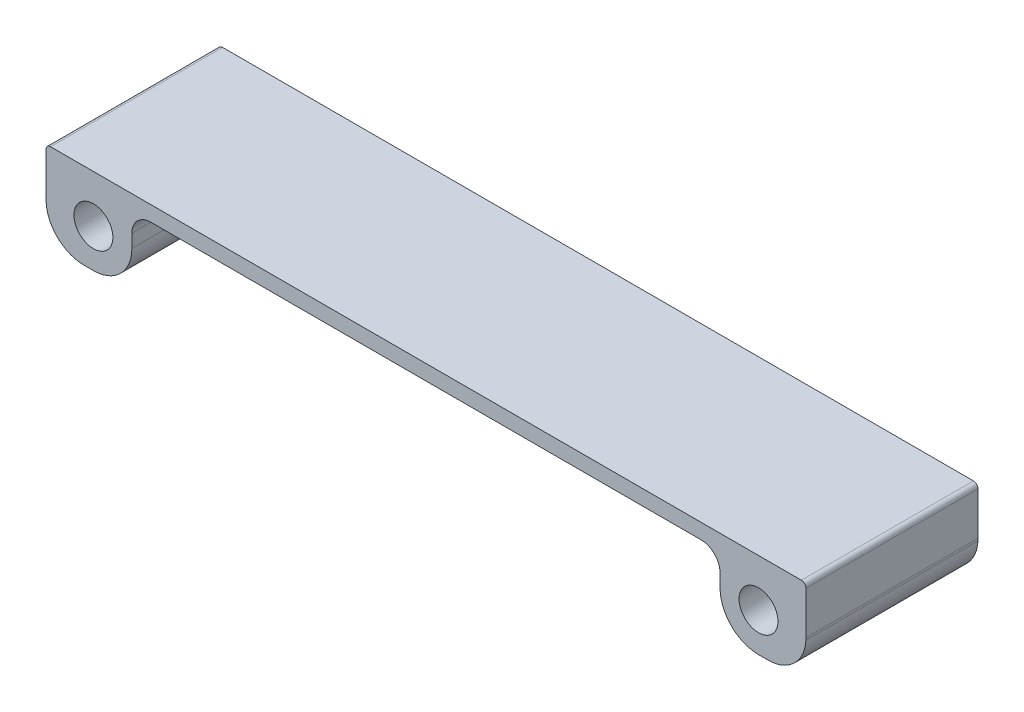
ISO-10303-21;
HEADER;
FILE_DESCRIPTION(('STEP AP214'),'2;1');
FILE_NAME('part.step','',(''),(''),'','','');
FILE_SCHEMA(('AUTOMOTIVE_DESIGN { 1 0 10303 214 1 1 1 1 }'));
ENDSEC;
DATA;
#1=APPLICATION_CONTEXT('core data for automotive mechanical design processes');
#2=APPLICATION_PROTOCOL_DEFINITION('international standard','automotive_design',2000,#1);
#3=PRODUCT_CONTEXT('',#1,'mechanical');
#4=PRODUCT('Part','Part','',(#3));
#5=PRODUCT_RELATED_PRODUCT_CATEGORY('part','',(#4));
#6=PRODUCT_DEFINITION_FORMATION('','',#4);
#7=PRODUCT_DEFINITION_CONTEXT('part definition',#1,'design');
#8=PRODUCT_DEFINITION('design','',#6,#7);
#9=PRODUCT_DEFINITION_SHAPE('','',#8);
#10=(LENGTH_UNIT() NAMED_UNIT(*) SI_UNIT(.MILLI.,.METRE.));
#11=(NAMED_UNIT(*) PLANE_ANGLE_UNIT() SI_UNIT($,.RADIAN.));
#12=(NAMED_UNIT(*) SI_UNIT($,.STERADIAN.) SOLID_ANGLE_UNIT());
#13=UNCERTAINTY_MEASURE_WITH_UNIT(LENGTH_MEASURE(1.E-05),#10,'distance_accuracy_value','');
#14=(GEOMETRIC_REPRESENTATION_CONTEXT(3) GLOBAL_UNCERTAINTY_ASSIGNED_CONTEXT((#13)) GLOBAL_UNIT_ASSIGNED_CONTEXT((#10,
#11,#12)) REPRESENTATION_CONTEXT('',''));
#15=CARTESIAN_POINT('',(0.,0.,0.));
#16=DIRECTION('',(0.,0.,1.));
#17=DIRECTION('',(1.,0.,0.));
#18=AXIS2_PLACEMENT_3D('',#15,#16,#17);
#19=CARTESIAN_POINT('',(111.1504,-6.4262,28.7528));
#20=DIRECTION('',(0.,1.,0.));
#21=DIRECTION('',(0.,0.,1.));
#22=AXIS2_PLACEMENT_3D('',#19,#20,#21);
#23=PLANE('',#22);
#24=DIRECTION('',(0.,0.,-1.));
#25=VECTOR('',#24,1.);
#26=CARTESIAN_POINT('',(112.723355371268,-6.42619999999999,28.7528));
#27=LINE('',#26,#25);
#28=CARTESIAN_POINT('',(112.723355371268,-6.4262,28.7528));
#29=VERTEX_POINT('',#28);
#30=CARTESIAN_POINT('',(112.723355371268,-6.4262,0.));
#31=VERTEX_POINT('',#30);
#32=EDGE_CURVE('E270',#29,#31,#27,.T.);
#33=ORIENTED_EDGE('',*,*,#32,.F.);
#34=DIRECTION('',(1.,0.,0.));
#35=VECTOR('',#34,1.);
#36=CARTESIAN_POINT('',(111.1504,-6.4262,28.7528));
#37=LINE('',#36,#35);
#38=CARTESIAN_POINT('',(111.1504,-6.4262,28.7528));
#39=VERTEX_POINT('',#38);
#40=EDGE_CURVE('E279',#39,#29,#37,.T.);
#41=ORIENTED_EDGE('',*,*,#40,.F.);
#42=DIRECTION('',(0.,0.,-1.));
#43=VECTOR('',#42,1.);
#44=CARTESIAN_POINT('',(111.1504,-6.42619999999999,28.7528));
#45=LINE('',#44,#43);
#46=CARTESIAN_POINT('',(111.1504,-6.4262,0.));
#47=VERTEX_POINT('',#46);
#48=EDGE_CURVE('E267',#47,#39,#45,.F.);
#49=ORIENTED_EDGE('',*,*,#48,.F.);
#50=DIRECTION('',(1.,0.,0.));
#51=VECTOR('',#50,1.);
#52=CARTESIAN_POINT('',(111.1504,-6.4262,0.));
#53=LINE('',#52,#51);
#54=EDGE_CURVE('E276',#31,#47,#53,.F.);
#55=ORIENTED_EDGE('',*,*,#54,.F.);
#56=EDGE_LOOP('',(#33,#41,#49,#55));
#57=FACE_BOUND('',#56,.T.);
#58=ADVANCED_FACE('F17',(#57),#23,.F.);
#59=CARTESIAN_POINT('',(0.,-6.4262,28.7528));
#60=DIRECTION('',(0.,1.,0.));
#61=DIRECTION('',(0.,0.,1.));
#62=AXIS2_PLACEMENT_3D('',#59,#60,#61);
#63=PLANE('',#62);
#64=DIRECTION('',(0.,0.,-1.));
#65=VECTOR('',#64,1.);
#66=CARTESIAN_POINT('',(-1.57295537126772,-6.4262,28.7528));
#67=LINE('',#66,#65);
#68=CARTESIAN_POINT('',(-1.57295537126772,-6.4262,0.));
#69=VERTEX_POINT('',#68);
#70=CARTESIAN_POINT('',(-1.57295537126772,-6.4262,28.7528));
#71=VERTEX_POINT('',#70);
#72=EDGE_CURVE('E153',#69,#71,#67,.F.);
#73=ORIENTED_EDGE('',*,*,#72,.F.);
#74=DIRECTION('',(1.,0.,0.));
#75=VECTOR('',#74,1.);
#76=CARTESIAN_POINT('',(0.,-6.4262,0.));
#77=LINE('',#76,#75);
#78=CARTESIAN_POINT('',(0.,-6.4262,0.));
#79=VERTEX_POINT('',#78);
#80=EDGE_CURVE('E159',#79,#69,#77,.F.);
#81=ORIENTED_EDGE('',*,*,#80,.F.);
#82=DIRECTION('',(0.,0.,-1.));
#83=VECTOR('',#82,1.);
#84=CARTESIAN_POINT('',(0.,-6.4262,28.7528));
#85=LINE('',#84,#83);
#86=CARTESIAN_POINT('',(0.,-6.4262,28.7528));
#87=VERTEX_POINT('',#86);
#88=EDGE_CURVE('E154',#87,#79,#85,.T.);
#89=ORIENTED_EDGE('',*,*,#88,.F.);
#90=DIRECTION('',(1.,0.,0.));
#91=VECTOR('',#90,1.);
#92=CARTESIAN_POINT('',(0.,-6.4262,28.7528));
#93=LINE('',#92,#91);
#94=EDGE_CURVE('E145',#71,#87,#93,.T.);
#95=ORIENTED_EDGE('',*,*,#94,.F.);
#96=EDGE_LOOP('',(#73,#81,#89,#95));
#97=FACE_BOUND('',#96,.T.);
#98=ADVANCED_FACE('F499',(#97),#63,.F.);
#99=CARTESIAN_POINT('',(0.,0.,28.7528));
#100=DIRECTION('',(0.,0.,-1.));
#101=DIRECTION('',(-1.,0.,0.));
#102=AXIS2_PLACEMENT_3D('',#99,#100,#101);
#103=CYLINDRICAL_SURFACE('',#102,7.92479999999999);
#104=CARTESIAN_POINT('',(0.,0.,28.7528));
#105=DIRECTION('',(0.,0.,-1.));
#106=DIRECTION('',(-1.,0.,0.));
#107=AXIS2_PLACEMENT_3D('',#104,#105,#106);
#108=CIRCLE('',#107,7.92479999999999);
#109=CARTESIAN_POINT('',(-7.91551735218598,-0.38345806451614,28.7528));
#110=VERTEX_POINT('',#109);
#111=CARTESIAN_POINT('',(-7.9248,0.,28.7528));
#112=VERTEX_POINT('',#111);
#113=EDGE_CURVE('E144',#110,#112,#108,.T.);
#114=ORIENTED_EDGE('',*,*,#113,.T.);
#115=DIRECTION('',(0.,0.,1.));
#116=VECTOR('',#115,1.);
#117=CARTESIAN_POINT('',(-7.9248,0.,28.7528));
#118=LINE('',#117,#116);
#119=CARTESIAN_POINT('',(-7.9248,0.,0.));
#120=VERTEX_POINT('',#119);
#121=EDGE_CURVE('E142',#112,#120,#118,.F.);
#122=ORIENTED_EDGE('',*,*,#121,.T.);
#123=CARTESIAN_POINT('',(0.,0.,0.));
#124=DIRECTION('',(0.,0.,-1.));
#125=DIRECTION('',(-1.,0.,0.));
#126=AXIS2_PLACEMENT_3D('',#123,#124,#125);
#127=CIRCLE('',#126,7.92479999999999);
#128=CARTESIAN_POINT('',(-7.91551735218598,-0.38345806451614,0.));
#129=VERTEX_POINT('',#128);
#130=EDGE_CURVE('E20',#120,#129,#127,.F.);
#131=ORIENTED_EDGE('',*,*,#130,.T.);
#132=DIRECTION('',(0.,0.,-1.));
#133=VECTOR('',#132,1.);
#134=CARTESIAN_POINT('',(-7.91551735218598,-0.383458064516141,28.7528));
#135=LINE('',#134,#133);
#136=EDGE_CURVE('E139',#110,#129,#135,.T.);
#137=ORIENTED_EDGE('',*,*,#136,.F.);
#138=EDGE_LOOP('',(#114,#122,#131,#137));
#139=FACE_BOUND('',#138,.T.);
#140=ADVANCED_FACE('F138',(#139),#103,.T.);
#141=CARTESIAN_POINT('',(111.1504,0.,28.7528));
#142=DIRECTION('',(0.,0.,-1.));
#143=DIRECTION('',(-1.,0.,0.));
#144=AXIS2_PLACEMENT_3D('',#141,#142,#143);
#145=CYLINDRICAL_SURFACE('',#144,7.9248);
#146=CARTESIAN_POINT('',(111.1504,0.,0.));
#147=DIRECTION('',(0.,0.,-1.));
#148=DIRECTION('',(-1.,0.,0.));
#149=AXIS2_PLACEMENT_3D('',#146,#147,#148);
#150=CIRCLE('',#149,7.9248);
#151=CARTESIAN_POINT('',(119.065917352186,-0.383458064516131,0.));
#152=VERTEX_POINT('',#151);
#153=CARTESIAN_POINT('',(119.0752,0.,0.));
#154=VERTEX_POINT('',#153);
#155=EDGE_CURVE('E215',#152,#154,#150,.F.);
#156=ORIENTED_EDGE('',*,*,#155,.T.);
#157=DIRECTION('',(0.,0.,1.));
#158=VECTOR('',#157,1.);
#159=CARTESIAN_POINT('',(119.0752,0.,28.7528));
#160=LINE('',#159,#158);
#161=CARTESIAN_POINT('',(119.0752,0.,28.7528));
#162=VERTEX_POINT('',#161);
#163=EDGE_CURVE('E226',#154,#162,#160,.T.);
#164=ORIENTED_EDGE('',*,*,#163,.T.);
#165=CARTESIAN_POINT('',(111.1504,0.,28.7528));
#166=DIRECTION('',(0.,0.,-1.));
#167=DIRECTION('',(-1.,0.,0.));
#168=AXIS2_PLACEMENT_3D('',#165,#166,#167);
#169=CIRCLE('',#168,7.9248);
#170=CARTESIAN_POINT('',(119.065917352186,-0.383458064516131,28.7528));
#171=VERTEX_POINT('',#170);
#172=EDGE_CURVE('E218',#162,#171,#169,.T.);
#173=ORIENTED_EDGE('',*,*,#172,.T.);
#174=DIRECTION('',(0.,0.,-1.));
#175=VECTOR('',#174,1.);
#176=CARTESIAN_POINT('',(119.065917352186,-0.38345806451613,28.7528));
#177=LINE('',#176,#175);
#178=EDGE_CURVE('E217',#152,#171,#177,.F.);
#179=ORIENTED_EDGE('',*,*,#178,.F.);
#180=EDGE_LOOP('',(#156,#164,#173,#179));
#181=FACE_BOUND('',#180,.T.);
#182=ADVANCED_FACE('F480',(#181),#145,.T.);
#183=CARTESIAN_POINT('',(112.723355371268,-0.0762000000000002,28.7528));
#184=DIRECTION('',(0.,0.,-1.));
#185=DIRECTION('',(-1.,0.,0.));
#186=AXIS2_PLACEMENT_3D('',#183,#184,#185);
#187=CYLINDRICAL_SURFACE('',#186,6.34999999999999);
#188=CARTESIAN_POINT('',(112.723355371268,-0.0762000000000002,28.7528));
#189=DIRECTION('',(0.,0.,-1.));
#190=DIRECTION('',(-1.,0.,0.));
#191=AXIS2_PLACEMENT_3D('',#188,#189,#190);
#192=CIRCLE('',#191,6.34999999999999);
#193=EDGE_CURVE('E187',#171,#29,#192,.T.);
#194=ORIENTED_EDGE('',*,*,#193,.T.);
#195=ORIENTED_EDGE('',*,*,#32,.T.);
#196=CARTESIAN_POINT('',(112.723355371268,-0.0762000000000002,0.));
#197=DIRECTION('',(0.,0.,-1.));
#198=DIRECTION('',(-1.,0.,0.));
#199=AXIS2_PLACEMENT_3D('',#196,#197,#198);
#200=CIRCLE('',#199,6.34999999999999);
#201=EDGE_CURVE('E178',#152,#31,#200,.T.);
#202=ORIENTED_EDGE('',*,*,#201,.F.);
#203=ORIENTED_EDGE('',*,*,#178,.T.);
#204=EDGE_LOOP('',(#194,#195,#202,#203));
#205=FACE_BOUND('',#204,.T.);
#206=ADVANCED_FACE('F470',(#205),#187,.T.);
#207=CARTESIAN_POINT('',(111.1504,0.,28.7528));
#208=DIRECTION('',(0.,0.,-1.));
#209=DIRECTION('',(-1.,0.,0.));
#210=AXIS2_PLACEMENT_3D('',#207,#208,#209);
#211=CYLINDRICAL_SURFACE('',#210,6.42619999999999);
#212=CARTESIAN_POINT('',(111.1504,0.,28.7528));
#213=DIRECTION('',(0.,0.,-1.));
#214=DIRECTION('',(-1.,0.,0.));
#215=AXIS2_PLACEMENT_3D('',#212,#213,#214);
#216=CIRCLE('',#215,6.42619999999999);
#217=CARTESIAN_POINT('',(104.7242,0.,28.7528));
#218=VERTEX_POINT('',#217);
#219=EDGE_CURVE('E208',#39,#218,#216,.T.);
#220=ORIENTED_EDGE('',*,*,#219,.T.);
#221=DIRECTION('',(0.,0.,1.));
#222=VECTOR('',#221,1.);
#223=CARTESIAN_POINT('',(104.7242,0.,28.7528));
#224=LINE('',#223,#222);
#225=CARTESIAN_POINT('',(104.7242,0.,0.));
#226=VERTEX_POINT('',#225);
#227=EDGE_CURVE('E264',#218,#226,#224,.F.);
#228=ORIENTED_EDGE('',*,*,#227,.T.);
#229=CARTESIAN_POINT('',(111.1504,0.,0.));
#230=DIRECTION('',(0.,0.,-1.));
#231=DIRECTION('',(-1.,0.,0.));
#232=AXIS2_PLACEMENT_3D('',#229,#230,#231);
#233=CIRCLE('',#232,6.42619999999999);
#234=EDGE_CURVE('E176',#47,#226,#233,.T.);
#235=ORIENTED_EDGE('',*,*,#234,.F.);
#236=ORIENTED_EDGE('',*,*,#48,.T.);
#237=EDGE_LOOP('',(#220,#228,#235,#236));
#238=FACE_BOUND('',#237,.T.);
#239=ADVANCED_FACE('F460',(#238),#211,.T.);
#240=CARTESIAN_POINT('',(104.7242,0.,28.7528));
#241=DIRECTION('',(1.,0.,0.));
#242=DIRECTION('',(0.,1.,0.));
#243=AXIS2_PLACEMENT_3D('',#240,#241,#242);
#244=PLANE('',#243);
#245=ORIENTED_EDGE('',*,*,#227,.F.);
#246=DIRECTION('',(0.,1.,0.));
#247=VECTOR('',#246,1.);
#248=CARTESIAN_POINT('',(104.7242,-5.6642,28.7528));
#249=LINE('',#248,#247);
#250=CARTESIAN_POINT('',(104.7242,2.2098,28.7528));
#251=VERTEX_POINT('',#250);
#252=EDGE_CURVE('E207',#218,#251,#249,.T.);
#253=ORIENTED_EDGE('',*,*,#252,.T.);
#254=DIRECTION('',(0.,0.,-1.));
#255=VECTOR('',#254,1.);
#256=CARTESIAN_POINT('',(104.7242,2.2098,28.7528));
#257=LINE('',#256,#255);
#258=CARTESIAN_POINT('',(104.7242,2.2098,0.));
#259=VERTEX_POINT('',#258);
#260=EDGE_CURVE('E261',#251,#259,#257,.T.);
#261=ORIENTED_EDGE('',*,*,#260,.T.);
#262=DIRECTION('',(0.,1.,0.));
#263=VECTOR('',#262,1.);
#264=CARTESIAN_POINT('',(104.7242,-5.6642,0.));
#265=LINE('',#264,#263);
#266=EDGE_CURVE('E175',#226,#259,#265,.T.);
#267=ORIENTED_EDGE('',*,*,#266,.F.);
#268=EDGE_LOOP('',(#245,#253,#261,#267));
#269=FACE_BOUND('',#268,.T.);
#270=ADVANCED_FACE('F450',(#269),#244,.F.);
#271=CARTESIAN_POINT('',(101.5492,2.2098,28.7528));
#272=DIRECTION('',(0.,0.,-1.));
#273=DIRECTION('',(-1.,0.,0.));
#274=AXIS2_PLACEMENT_3D('',#271,#272,#273);
#275=CYLINDRICAL_SURFACE('',#274,3.17500000000001);
#276=ORIENTED_EDGE('',*,*,#260,.F.);
#277=CARTESIAN_POINT('',(101.5492,2.2098,28.7528));
#278=DIRECTION('',(0.,0.,-1.));
#279=DIRECTION('',(-1.,0.,0.));
#280=AXIS2_PLACEMENT_3D('',#277,#278,#279);
#281=CIRCLE('',#280,3.17500000000001);
#282=CARTESIAN_POINT('',(101.5492,5.3848,28.7528));
#283=VERTEX_POINT('',#282);
#284=EDGE_CURVE('E204',#251,#283,#281,.F.);
#285=ORIENTED_EDGE('',*,*,#284,.T.);
#286=DIRECTION('',(0.,0.,1.));
#287=VECTOR('',#286,1.);
#288=CARTESIAN_POINT('',(101.5492,5.3848,28.7528));
#289=LINE('',#288,#287);
#290=CARTESIAN_POINT('',(101.5492,5.3848,0.));
#291=VERTEX_POINT('',#290);
#292=EDGE_CURVE('E258',#283,#291,#289,.F.);
#293=ORIENTED_EDGE('',*,*,#292,.T.);
#294=CARTESIAN_POINT('',(101.5492,2.2098,0.));
#295=DIRECTION('',(0.,0.,-1.));
#296=DIRECTION('',(-1.,0.,0.));
#297=AXIS2_PLACEMENT_3D('',#294,#295,#296);
#298=CIRCLE('',#297,3.17500000000001);
#299=EDGE_CURVE('E173',#259,#291,#298,.F.);
#300=ORIENTED_EDGE('',*,*,#299,.F.);
#301=EDGE_LOOP('',(#276,#285,#293,#300));
#302=FACE_BOUND('',#301,.T.);
#303=ADVANCED_FACE('F440',(#302),#275,.F.);
#304=CARTESIAN_POINT('',(101.5492,5.3848,28.7528));
#305=DIRECTION('',(0.,1.,0.));
#306=DIRECTION('',(-1.,0.,0.));
#307=AXIS2_PLACEMENT_3D('',#304,#305,#306);
#308=PLANE('',#307);
#309=ORIENTED_EDGE('',*,*,#292,.F.);
#310=DIRECTION('',(-1.,0.,0.));
#311=VECTOR('',#310,1.);
#312=CARTESIAN_POINT('',(-7.1628,5.3848,28.7528));
#313=LINE('',#312,#311);
#314=CARTESIAN_POINT('',(9.6012,5.38479999999999,28.7528));
#315=VERTEX_POINT('',#314);
#316=EDGE_CURVE('E203',#283,#315,#313,.T.);
#317=ORIENTED_EDGE('',*,*,#316,.T.);
#318=DIRECTION('',(0.,0.,-1.));
#319=VECTOR('',#318,1.);
#320=CARTESIAN_POINT('',(9.6012,5.38479999999999,28.7528));
#321=LINE('',#320,#319);
#322=CARTESIAN_POINT('',(9.6012,5.38479999999999,0.));
#323=VERTEX_POINT('',#322);
#324=EDGE_CURVE('E255',#315,#323,#321,.T.);
#325=ORIENTED_EDGE('',*,*,#324,.T.);
#326=DIRECTION('',(-1.,0.,0.));
#327=VECTOR('',#326,1.);
#328=CARTESIAN_POINT('',(-7.1628,5.3848,0.));
#329=LINE('',#328,#327);
#330=EDGE_CURVE('E172',#291,#323,#329,.T.);
#331=ORIENTED_EDGE('',*,*,#330,.F.);
#332=EDGE_LOOP('',(#309,#317,#325,#331));
#333=FACE_BOUND('',#332,.T.);
#334=ADVANCED_FACE('F430',(#333),#308,.F.);
#335=CARTESIAN_POINT('',(9.6012,2.20979999999999,28.7528));
#336=DIRECTION('',(0.,0.,-1.));
#337=DIRECTION('',(-1.,0.,0.));
#338=AXIS2_PLACEMENT_3D('',#335,#336,#337);
#339=CYLINDRICAL_SURFACE('',#338,3.175);
#340=ORIENTED_EDGE('',*,*,#324,.F.);
#341=CARTESIAN_POINT('',(9.6012,2.20979999999999,28.7528));
#342=DIRECTION('',(0.,0.,-1.));
#343=DIRECTION('',(-1.,0.,0.));
#344=AXIS2_PLACEMENT_3D('',#341,#342,#343);
#345=CIRCLE('',#344,3.175);
#346=CARTESIAN_POINT('',(6.4262,2.20979999999999,28.7528));
#347=VERTEX_POINT('',#346);
#348=EDGE_CURVE('E200',#315,#347,#345,.F.);
#349=ORIENTED_EDGE('',*,*,#348,.T.);
#350=DIRECTION('',(0.,0.,1.));
#351=VECTOR('',#350,1.);
#352=CARTESIAN_POINT('',(6.4262,2.20979999999999,28.7528));
#353=LINE('',#352,#351);
#354=CARTESIAN_POINT('',(6.4262,2.20979999999999,0.));
#355=VERTEX_POINT('',#354);
#356=EDGE_CURVE('E252',#347,#355,#353,.F.);
#357=ORIENTED_EDGE('',*,*,#356,.T.);
#358=CARTESIAN_POINT('',(9.6012,2.20979999999999,0.));
#359=DIRECTION('',(0.,0.,-1.));
#360=DIRECTION('',(-1.,0.,0.));
#361=AXIS2_PLACEMENT_3D('',#358,#359,#360);
#362=CIRCLE('',#361,3.175);
#363=EDGE_CURVE('E170',#323,#355,#362,.F.);
#364=ORIENTED_EDGE('',*,*,#363,.F.);
#365=EDGE_LOOP('',(#340,#349,#357,#364));
#366=FACE_BOUND('',#365,.T.);
#367=ADVANCED_FACE('F420',(#366),#339,.F.);
#368=CARTESIAN_POINT('',(6.4262,0.,28.7528));
#369=DIRECTION('',(-1.,0.,0.));
#370=DIRECTION('',(0.,0.,1.));
#371=AXIS2_PLACEMENT_3D('',#368,#369,#370);
#372=PLANE('',#371);
#373=ORIENTED_EDGE('',*,*,#356,.F.);
#374=DIRECTION('',(0.,1.,0.));
#375=VECTOR('',#374,1.);
#376=CARTESIAN_POINT('',(6.4262,-5.6642,28.7528));
#377=LINE('',#376,#375);
#378=CARTESIAN_POINT('',(6.4262,0.,28.7528));
#379=VERTEX_POINT('',#378);
#380=EDGE_CURVE('E199',#347,#379,#377,.F.);
#381=ORIENTED_EDGE('',*,*,#380,.T.);
#382=DIRECTION('',(0.,0.,-1.));
#383=VECTOR('',#382,1.);
#384=CARTESIAN_POINT('',(6.4262,0.,28.7528));
#385=LINE('',#384,#383);
#386=CARTESIAN_POINT('',(6.4262,0.,0.));
#387=VERTEX_POINT('',#386);
#388=EDGE_CURVE('E250',#387,#379,#385,.F.);
#389=ORIENTED_EDGE('',*,*,#388,.F.);
#390=DIRECTION('',(0.,1.,0.));
#391=VECTOR('',#390,1.);
#392=CARTESIAN_POINT('',(6.4262,-5.6642,0.));
#393=LINE('',#392,#391);
#394=EDGE_CURVE('E165',#355,#387,#393,.F.);
#395=ORIENTED_EDGE('',*,*,#394,.F.);
#396=EDGE_LOOP('',(#373,#381,#389,#395));
#397=FACE_BOUND('',#396,.T.);
#398=ADVANCED_FACE('F410',(#397),#372,.F.);
#399=CARTESIAN_POINT('',(0.,0.,28.7528));
#400=DIRECTION('',(0.,0.,-1.));
#401=DIRECTION('',(-1.,0.,0.));
#402=AXIS2_PLACEMENT_3D('',#399,#400,#401);
#403=CYLINDRICAL_SURFACE('',#402,6.4262);
#404=CARTESIAN_POINT('',(0.,0.,28.7528));
#405=DIRECTION('',(0.,0.,-1.));
#406=DIRECTION('',(-1.,0.,0.));
#407=AXIS2_PLACEMENT_3D('',#404,#405,#406);
#408=CIRCLE('',#407,6.4262);
#409=EDGE_CURVE('E196',#379,#87,#408,.T.);
#410=ORIENTED_EDGE('',*,*,#409,.T.);
#411=ORIENTED_EDGE('',*,*,#88,.T.);
#412=CARTESIAN_POINT('',(0.,0.,0.));
#413=DIRECTION('',(0.,0.,-1.));
#414=DIRECTION('',(-1.,0.,0.));
#415=AXIS2_PLACEMENT_3D('',#412,#413,#414);
#416=CIRCLE('',#415,6.4262);
#417=EDGE_CURVE('E162',#387,#79,#416,.T.);
#418=ORIENTED_EDGE('',*,*,#417,.F.);
#419=ORIENTED_EDGE('',*,*,#388,.T.);
#420=EDGE_LOOP('',(#410,#411,#418,#419));
#421=FACE_BOUND('',#420,.T.);
#422=ADVANCED_FACE('F401',(#421),#403,.T.);
#423=CARTESIAN_POINT('',(-1.57295537126772,-0.0762000000000002,28.7528));
#424=DIRECTION('',(0.,0.,-1.));
#425=DIRECTION('',(-1.,0.,0.));
#426=AXIS2_PLACEMENT_3D('',#423,#424,#425);
#427=CYLINDRICAL_SURFACE('',#426,6.35);
#428=CARTESIAN_POINT('',(-1.57295537126772,-0.0762000000000002,0.));
#429=DIRECTION('',(0.,0.,-1.));
#430=DIRECTION('',(-1.,0.,0.));
#431=AXIS2_PLACEMENT_3D('',#428,#429,#430);
#432=CIRCLE('',#431,6.35);
#433=EDGE_CURVE('E150',#69,#129,#432,.T.);
#434=ORIENTED_EDGE('',*,*,#433,.F.);
#435=ORIENTED_EDGE('',*,*,#72,.T.);
#436=CARTESIAN_POINT('',(-1.57295537126772,-0.0762000000000002,28.7528));
#437=DIRECTION('',(0.,0.,-1.));
#438=DIRECTION('',(-1.,0.,0.));
#439=AXIS2_PLACEMENT_3D('',#436,#437,#438);
#440=CIRCLE('',#439,6.35);
#441=EDGE_CURVE('E152',#71,#110,#440,.T.);
#442=ORIENTED_EDGE('',*,*,#441,.T.);
#443=ORIENTED_EDGE('',*,*,#136,.T.);
#444=EDGE_LOOP('',(#434,#435,#442,#443));
#445=FACE_BOUND('',#444,.T.);
#446=ADVANCED_FACE('F148',(#445),#427,.T.);
#447=CARTESIAN_POINT('',(-7.9248,7.16279999999999,28.7528));
#448=DIRECTION('',(1.,0.,0.));
#449=DIRECTION('',(0.,1.,0.));
#450=AXIS2_PLACEMENT_3D('',#447,#448,#449);
#451=PLANE('',#450);
#452=ORIENTED_EDGE('',*,*,#121,.F.);
#453=DIRECTION('',(0.,1.,0.));
#454=VECTOR('',#453,1.);
#455=CARTESIAN_POINT('',(-7.9248,-5.6642,28.7528));
#456=LINE('',#455,#454);
#457=CARTESIAN_POINT('',(-7.9248,7.1628,28.7528));
#458=VERTEX_POINT('',#457);
#459=EDGE_CURVE('E194',#112,#458,#456,.T.);
#460=ORIENTED_EDGE('',*,*,#459,.T.);
#461=DIRECTION('',(0.,0.,-1.));
#462=VECTOR('',#461,1.);
#463=CARTESIAN_POINT('',(-7.9248,7.1628,28.7528));
#464=LINE('',#463,#462);
#465=CARTESIAN_POINT('',(-7.9248,7.1628,0.));
#466=VERTEX_POINT('',#465);
#467=EDGE_CURVE('E183',#466,#458,#464,.F.);
#468=ORIENTED_EDGE('',*,*,#467,.F.);
#469=DIRECTION('',(0.,1.,0.));
#470=VECTOR('',#469,1.);
#471=CARTESIAN_POINT('',(-7.9248,-5.6642,0.));
#472=LINE('',#471,#470);
#473=EDGE_CURVE('E161',#120,#466,#472,.T.);
#474=ORIENTED_EDGE('',*,*,#473,.F.);
#475=EDGE_LOOP('',(#452,#460,#468,#474));
#476=FACE_BOUND('',#475,.T.);
#477=ADVANCED_FACE('F223',(#476),#451,.F.);
#478=CARTESIAN_POINT('',(119.0752,7.16279999999999,28.7528));
#479=DIRECTION('',(-1.,0.,0.));
#480=DIRECTION('',(0.,0.,1.));
#481=AXIS2_PLACEMENT_3D('',#478,#479,#480);
#482=PLANE('',#481);
#483=DIRECTION('',(0.,1.,0.));
#484=VECTOR('',#483,1.);
#485=CARTESIAN_POINT('',(119.0752,-5.6642,0.));
#486=LINE('',#485,#484);
#487=CARTESIAN_POINT('',(119.0752,7.1628,0.));
#488=VERTEX_POINT('',#487);
#489=EDGE_CURVE('E287',#488,#154,#486,.F.);
#490=ORIENTED_EDGE('',*,*,#489,.F.);
#491=DIRECTION('',(0.,0.,-1.));
#492=VECTOR('',#491,1.);
#493=CARTESIAN_POINT('',(119.0752,7.16279999999999,28.7528));
#494=LINE('',#493,#492);
#495=CARTESIAN_POINT('',(119.0752,7.1628,28.7528));
#496=VERTEX_POINT('',#495);
#497=EDGE_CURVE('E214',#496,#488,#494,.T.);
#498=ORIENTED_EDGE('',*,*,#497,.F.);
#499=DIRECTION('',(0.,1.,0.));
#500=VECTOR('',#499,1.);
#501=CARTESIAN_POINT('',(119.0752,-5.6642,28.7528));
#502=LINE('',#501,#500);
#503=EDGE_CURVE('E190',#496,#162,#502,.F.);
#504=ORIENTED_EDGE('',*,*,#503,.T.);
#505=ORIENTED_EDGE('',*,*,#163,.F.);
#506=EDGE_LOOP('',(#490,#498,#504,#505));
#507=FACE_BOUND('',#506,.T.);
#508=ADVANCED_FACE('F374',(#507),#482,.F.);
#509=CARTESIAN_POINT('',(0.,0.,28.7528));
#510=DIRECTION('',(0.,0.,-1.));
#511=DIRECTION('',(-1.,0.,0.));
#512=AXIS2_PLACEMENT_3D('',#509,#510,#511);
#513=CYLINDRICAL_SURFACE('',#512,3.2512);
#514=CARTESIAN_POINT('',(0.,0.,28.7528));
#515=DIRECTION('',(0.,0.,-1.));
#516=DIRECTION('',(-1.,0.,0.));
#517=AXIS2_PLACEMENT_3D('',#514,#515,#516);
#518=CIRCLE('',#517,3.2512);
#519=CARTESIAN_POINT('',(-3.2512,0.,28.7528));
#520=VERTEX_POINT('',#519);
#521=EDGE_CURVE('E211',#520,#520,#518,.F.);
#522=ORIENTED_EDGE('',*,*,#521,.T.);
#523=EDGE_LOOP('',(#522));
#524=FACE_BOUND('',#523,.T.);
#525=CARTESIAN_POINT('',(0.,0.,0.));
#526=DIRECTION('',(0.,0.,-1.));
#527=DIRECTION('',(-1.,0.,0.));
#528=AXIS2_PLACEMENT_3D('',#525,#526,#527);
#529=CIRCLE('',#528,3.2512);
#530=CARTESIAN_POINT('',(-3.2512,0.,0.));
#531=VERTEX_POINT('',#530);
#532=EDGE_CURVE('E285',#531,#531,#529,.F.);
#533=ORIENTED_EDGE('',*,*,#532,.F.);
#534=EDGE_LOOP('',(#533));
#535=FACE_BOUND('',#534,.T.);
#536=ADVANCED_FACE('F364',(#524,#535),#513,.F.);
#537=CARTESIAN_POINT('',(111.1504,0.,28.7528));
#538=DIRECTION('',(0.,0.,-1.));
#539=DIRECTION('',(-1.,0.,0.));
#540=AXIS2_PLACEMENT_3D('',#537,#538,#539);
#541=CYLINDRICAL_SURFACE('',#540,3.2512);
#542=CARTESIAN_POINT('',(111.1504,0.,28.7528));
#543=DIRECTION('',(0.,0.,-1.));
#544=DIRECTION('',(-1.,0.,0.));
#545=AXIS2_PLACEMENT_3D('',#542,#543,#544);
#546=CIRCLE('',#545,3.2512);
#547=CARTESIAN_POINT('',(107.8992,0.,28.7528));
#548=VERTEX_POINT('',#547);
#549=EDGE_CURVE('E184',#548,#548,#546,.F.);
#550=ORIENTED_EDGE('',*,*,#549,.T.);
#551=EDGE_LOOP('',(#550));
#552=FACE_BOUND('',#551,.T.);
#553=CARTESIAN_POINT('',(111.1504,0.,0.));
#554=DIRECTION('',(0.,0.,-1.));
#555=DIRECTION('',(-1.,0.,0.));
#556=AXIS2_PLACEMENT_3D('',#553,#554,#555);
#557=CIRCLE('',#556,3.2512);
#558=CARTESIAN_POINT('',(107.8992,0.,0.));
#559=VERTEX_POINT('',#558);
#560=EDGE_CURVE('E281',#559,#559,#557,.F.);
#561=ORIENTED_EDGE('',*,*,#560,.F.);
#562=EDGE_LOOP('',(#561));
#563=FACE_BOUND('',#562,.T.);
#564=ADVANCED_FACE('F355',(#552,#563),#541,.F.);
#565=CARTESIAN_POINT('',(118.3132,7.1628,28.7528));
#566=DIRECTION('',(0.,0.,-1.));
#567=DIRECTION('',(-1.,0.,0.));
#568=AXIS2_PLACEMENT_3D('',#565,#566,#567);
#569=CYLINDRICAL_SURFACE('',#568,0.761999999999999);
#570=CARTESIAN_POINT('',(118.3132,7.1628,28.7528));
#571=DIRECTION('',(0.,0.,-1.));
#572=DIRECTION('',(-1.,0.,0.));
#573=AXIS2_PLACEMENT_3D('',#570,#571,#572);
#574=CIRCLE('',#573,0.761999999999999);
#575=CARTESIAN_POINT('',(118.3132,7.9248,28.7528));
#576=VERTEX_POINT('',#575);
#577=EDGE_CURVE('E191',#576,#496,#574,.T.);
#578=ORIENTED_EDGE('',*,*,#577,.T.);
#579=ORIENTED_EDGE('',*,*,#497,.T.);
#580=CARTESIAN_POINT('',(118.3132,7.1628,0.));
#581=DIRECTION('',(0.,0.,-1.));
#582=DIRECTION('',(-1.,0.,0.));
#583=AXIS2_PLACEMENT_3D('',#580,#581,#582);
#584=CIRCLE('',#583,0.761999999999999);
#585=CARTESIAN_POINT('',(118.3132,7.9248,0.));
#586=VERTEX_POINT('',#585);
#587=EDGE_CURVE('E288',#586,#488,#584,.T.);
#588=ORIENTED_EDGE('',*,*,#587,.F.);
#589=DIRECTION('',(0.,0.,-1.));
#590=VECTOR('',#589,1.);
#591=CARTESIAN_POINT('',(118.3132,7.9248,28.7528));
#592=LINE('',#591,#590);
#593=EDGE_CURVE('E284',#586,#576,#592,.F.);
#594=ORIENTED_EDGE('',*,*,#593,.T.);
#595=EDGE_LOOP('',(#578,#579,#588,#594));
#596=FACE_BOUND('',#595,.T.);
#597=ADVANCED_FACE('F308',(#596),#569,.T.);
#598=CARTESIAN_POINT('',(-7.1628,-5.6642,28.7528));
#599=DIRECTION('',(0.,0.,-1.));
#600=DIRECTION('',(-1.,0.,0.));
#601=AXIS2_PLACEMENT_3D('',#598,#599,#600);
#602=PLANE('',#601);
#603=ORIENTED_EDGE('',*,*,#549,.F.);
#604=EDGE_LOOP('',(#603));
#605=FACE_BOUND('',#604,.T.);
#606=ORIENTED_EDGE('',*,*,#193,.F.);
#607=ORIENTED_EDGE('',*,*,#172,.F.);
#608=ORIENTED_EDGE('',*,*,#503,.F.);
#609=ORIENTED_EDGE('',*,*,#577,.F.);
#610=DIRECTION('',(1.,0.,0.));
#611=VECTOR('',#610,1.);
#612=CARTESIAN_POINT('',(-7.16279999999999,7.9248,28.7528));
#613=LINE('',#612,#611);
#614=CARTESIAN_POINT('',(-7.1628,7.9248,28.7528));
#615=VERTEX_POINT('',#614);
#616=EDGE_CURVE('E298',#576,#615,#613,.F.);
#617=ORIENTED_EDGE('',*,*,#616,.T.);
#618=CARTESIAN_POINT('',(-7.1628,7.1628,28.7528));
#619=DIRECTION('',(0.,0.,-1.));
#620=DIRECTION('',(-1.,0.,0.));
#621=AXIS2_PLACEMENT_3D('',#618,#619,#620);
#622=CIRCLE('',#621,0.762000000000001);
#623=EDGE_CURVE('E181',#458,#615,#622,.T.);
#624=ORIENTED_EDGE('',*,*,#623,.F.);
#625=ORIENTED_EDGE('',*,*,#459,.F.);
#626=ORIENTED_EDGE('',*,*,#113,.F.);
#627=ORIENTED_EDGE('',*,*,#441,.F.);
#628=ORIENTED_EDGE('',*,*,#94,.T.);
#629=ORIENTED_EDGE('',*,*,#409,.F.);
#630=ORIENTED_EDGE('',*,*,#380,.F.);
#631=ORIENTED_EDGE('',*,*,#348,.F.);
#632=ORIENTED_EDGE('',*,*,#316,.F.);
#633=ORIENTED_EDGE('',*,*,#284,.F.);
#634=ORIENTED_EDGE('',*,*,#252,.F.);
#635=ORIENTED_EDGE('',*,*,#219,.F.);
#636=ORIENTED_EDGE('',*,*,#40,.T.);
#637=EDGE_LOOP('',(#606,#607,#608,#609,#617,#624,#625,#626,#627,#628,#629,#630,#631,#632,#633,
#634,#635,#636));
#638=FACE_BOUND('',#637,.T.);
#639=ORIENTED_EDGE('',*,*,#521,.F.);
#640=EDGE_LOOP('',(#639));
#641=FACE_BOUND('',#640,.T.);
#642=ADVANCED_FACE('F229',(#605,#638,#641),#602,.F.);
#643=CARTESIAN_POINT('',(-7.1628,7.1628,28.7528));
#644=DIRECTION('',(0.,0.,-1.));
#645=DIRECTION('',(-1.,0.,0.));
#646=AXIS2_PLACEMENT_3D('',#643,#644,#645);
#647=CYLINDRICAL_SURFACE('',#646,0.762000000000001);
#648=ORIENTED_EDGE('',*,*,#623,.T.);
#649=DIRECTION('',(0.,0.,-1.));
#650=VECTOR('',#649,1.);
#651=CARTESIAN_POINT('',(-7.16279999999999,7.9248,28.7528));
#652=LINE('',#651,#650);
#653=CARTESIAN_POINT('',(-7.1628,7.9248,0.));
#654=VERTEX_POINT('',#653);
#655=EDGE_CURVE('E26',#615,#654,#652,.T.);
#656=ORIENTED_EDGE('',*,*,#655,.T.);
#657=CARTESIAN_POINT('',(-7.1628,7.1628,0.));
#658=DIRECTION('',(0.,0.,-1.));
#659=DIRECTION('',(-1.,0.,0.));
#660=AXIS2_PLACEMENT_3D('',#657,#658,#659);
#661=CIRCLE('',#660,0.762000000000001);
#662=EDGE_CURVE('E34',#466,#654,#661,.T.);
#663=ORIENTED_EDGE('',*,*,#662,.F.);
#664=ORIENTED_EDGE('',*,*,#467,.T.);
#665=EDGE_LOOP('',(#648,#656,#663,#664));
#666=FACE_BOUND('',#665,.T.);
#667=ADVANCED_FACE('F311',(#666),#647,.T.);
#668=CARTESIAN_POINT('',(-7.1628,-5.6642,0.));
#669=DIRECTION('',(0.,0.,-1.));
#670=DIRECTION('',(-1.,0.,0.));
#671=AXIS2_PLACEMENT_3D('',#668,#669,#670);
#672=PLANE('',#671);
#673=ORIENTED_EDGE('',*,*,#560,.T.);
#674=EDGE_LOOP('',(#673));
#675=FACE_BOUND('',#674,.T.);
#676=ORIENTED_EDGE('',*,*,#532,.T.);
#677=EDGE_LOOP('',(#676));
#678=FACE_BOUND('',#677,.T.);
#679=ORIENTED_EDGE('',*,*,#587,.T.);
#680=ORIENTED_EDGE('',*,*,#489,.T.);
#681=ORIENTED_EDGE('',*,*,#155,.F.);
#682=ORIENTED_EDGE('',*,*,#201,.T.);
#683=ORIENTED_EDGE('',*,*,#54,.T.);
#684=ORIENTED_EDGE('',*,*,#234,.T.);
#685=ORIENTED_EDGE('',*,*,#266,.T.);
#686=ORIENTED_EDGE('',*,*,#299,.T.);
#687=ORIENTED_EDGE('',*,*,#330,.T.);
#688=ORIENTED_EDGE('',*,*,#363,.T.);
#689=ORIENTED_EDGE('',*,*,#394,.T.);
#690=ORIENTED_EDGE('',*,*,#417,.T.);
#691=ORIENTED_EDGE('',*,*,#80,.T.);
#692=ORIENTED_EDGE('',*,*,#433,.T.);
#693=ORIENTED_EDGE('',*,*,#130,.F.);
#694=ORIENTED_EDGE('',*,*,#473,.T.);
#695=ORIENTED_EDGE('',*,*,#662,.T.);
#696=DIRECTION('',(1.,0.,0.));
#697=VECTOR('',#696,1.);
#698=CARTESIAN_POINT('',(-7.16279999999999,7.9248,0.));
#699=LINE('',#698,#697);
#700=EDGE_CURVE('E11',#654,#586,#699,.T.);
#701=ORIENTED_EDGE('',*,*,#700,.T.);
#702=EDGE_LOOP('',(#679,#680,#681,#682,#683,#684,#685,#686,#687,#688,#689,#690,#691,#692,#693,
#694,#695,#701));
#703=FACE_BOUND('',#702,.T.);
#704=ADVANCED_FACE('F157',(#675,#678,#703),#672,.T.);
#705=CARTESIAN_POINT('',(-7.16279999999999,7.9248,28.7528));
#706=DIRECTION('',(0.,-1.,0.));
#707=DIRECTION('',(0.,0.,-1.));
#708=AXIS2_PLACEMENT_3D('',#705,#706,#707);
#709=PLANE('',#708);
#710=ORIENTED_EDGE('',*,*,#655,.F.);
#711=ORIENTED_EDGE('',*,*,#616,.F.);
#712=ORIENTED_EDGE('',*,*,#593,.F.);
#713=ORIENTED_EDGE('',*,*,#700,.F.);
#714=EDGE_LOOP('',(#710,#711,#712,#713));
#715=FACE_BOUND('',#714,.T.);
#716=ADVANCED_FACE('F306',(#715),#709,.F.);
#717=CLOSED_SHELL('',(#58,#98,#140,#182,#206,#239,#270,#303,#334,#367,#398,#422,#446,#477,#508,
#536,#564,#597,#642,#667,#704,#716));
#718=MANIFOLD_SOLID_BREP('B1',#717);
#719=ADVANCED_BREP_SHAPE_REPRESENTATION('',(#18,#718),#14);
#720=SHAPE_DEFINITION_REPRESENTATION(#9,#719);
ENDSEC;
END-ISO-10303-21;
